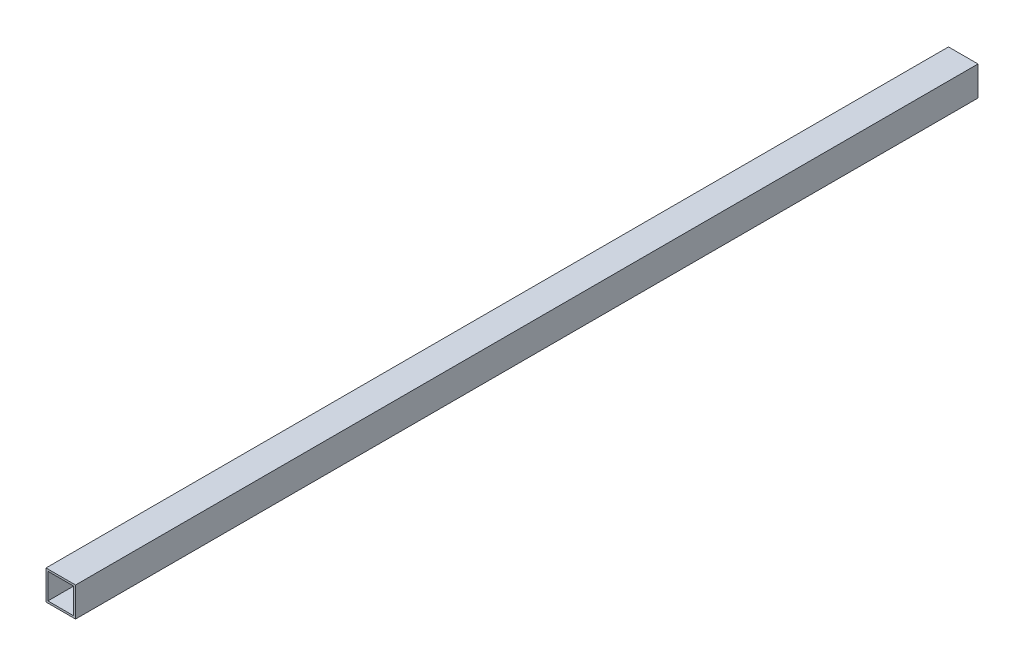
ISO-10303-21;
HEADER;
FILE_DESCRIPTION(('STEP AP214'),'2;1');
FILE_NAME('part.step','',(''),(''),'','','');
FILE_SCHEMA(('AUTOMOTIVE_DESIGN { 1 0 10303 214 1 1 1 1 }'));
ENDSEC;
DATA;
#1=APPLICATION_CONTEXT('core data for automotive mechanical design processes');
#2=APPLICATION_PROTOCOL_DEFINITION('international standard','automotive_design',2000,#1);
#3=PRODUCT_CONTEXT('',#1,'mechanical');
#4=PRODUCT('Part','Part','',(#3));
#5=PRODUCT_RELATED_PRODUCT_CATEGORY('part','',(#4));
#6=PRODUCT_DEFINITION_FORMATION('','',#4);
#7=PRODUCT_DEFINITION_CONTEXT('part definition',#1,'design');
#8=PRODUCT_DEFINITION('design','',#6,#7);
#9=PRODUCT_DEFINITION_SHAPE('','',#8);
#10=(LENGTH_UNIT() NAMED_UNIT(*) SI_UNIT(.MILLI.,.METRE.));
#11=(NAMED_UNIT(*) PLANE_ANGLE_UNIT() SI_UNIT($,.RADIAN.));
#12=(NAMED_UNIT(*) SI_UNIT($,.STERADIAN.) SOLID_ANGLE_UNIT());
#13=UNCERTAINTY_MEASURE_WITH_UNIT(LENGTH_MEASURE(1.E-05),#10,'distance_accuracy_value','');
#14=(GEOMETRIC_REPRESENTATION_CONTEXT(3) GLOBAL_UNCERTAINTY_ASSIGNED_CONTEXT((#13)) GLOBAL_UNIT_ASSIGNED_CONTEXT((#10,
#11,#12)) REPRESENTATION_CONTEXT('',''));
#15=CARTESIAN_POINT('',(0.,0.,0.));
#16=DIRECTION('',(0.,0.,1.));
#17=DIRECTION('',(1.,0.,0.));
#18=AXIS2_PLACEMENT_3D('',#15,#16,#17);
#19=CARTESIAN_POINT('',(-12.7,12.7,-776.));
#20=DIRECTION('',(1.,0.,0.));
#21=DIRECTION('',(0.,0.,-1.));
#22=AXIS2_PLACEMENT_3D('',#19,#20,#21);
#23=PLANE('',#22);
#24=DIRECTION('',(0.,1.,0.));
#25=VECTOR('',#24,1.);
#26=CARTESIAN_POINT('',(-12.7,12.7,0.));
#27=LINE('',#26,#25);
#28=CARTESIAN_POINT('',(-12.7,-12.7,0.));
#29=VERTEX_POINT('',#28);
#30=CARTESIAN_POINT('',(-12.7,12.7,0.));
#31=VERTEX_POINT('',#30);
#32=EDGE_CURVE('E164',#29,#31,#27,.T.);
#33=ORIENTED_EDGE('',*,*,#32,.T.);
#34=DIRECTION('',(0.,0.,1.));
#35=VECTOR('',#34,1.);
#36=CARTESIAN_POINT('',(-12.7,12.7,-776.));
#37=LINE('',#36,#35);
#38=CARTESIAN_POINT('',(-12.7,12.7,-776.));
#39=VERTEX_POINT('',#38);
#40=EDGE_CURVE('E12',#39,#31,#37,.T.);
#41=ORIENTED_EDGE('',*,*,#40,.F.);
#42=DIRECTION('',(0.,1.,0.));
#43=VECTOR('',#42,1.);
#44=CARTESIAN_POINT('',(-12.7,12.7,-776.));
#45=LINE('',#44,#43);
#46=CARTESIAN_POINT('',(-12.7,-12.7,-776.));
#47=VERTEX_POINT('',#46);
#48=EDGE_CURVE('E138',#47,#39,#45,.T.);
#49=ORIENTED_EDGE('',*,*,#48,.F.);
#50=DIRECTION('',(0.,0.,1.));
#51=VECTOR('',#50,1.);
#52=CARTESIAN_POINT('',(-12.7,-12.7,-776.));
#53=LINE('',#52,#51);
#54=EDGE_CURVE('E171',#47,#29,#53,.T.);
#55=ORIENTED_EDGE('',*,*,#54,.T.);
#56=EDGE_LOOP('',(#33,#41,#49,#55));
#57=FACE_BOUND('',#56,.T.);
#58=ADVANCED_FACE('F57',(#57),#23,.F.);
#59=CARTESIAN_POINT('',(-12.7,12.7,-776.));
#60=DIRECTION('',(0.,-1.,0.));
#61=DIRECTION('',(0.,0.,-1.));
#62=AXIS2_PLACEMENT_3D('',#59,#60,#61);
#63=PLANE('',#62);
#64=DIRECTION('',(1.,0.,0.));
#65=VECTOR('',#64,1.);
#66=CARTESIAN_POINT('',(-12.7,12.7,0.));
#67=LINE('',#66,#65);
#68=CARTESIAN_POINT('',(12.7,12.7,0.));
#69=VERTEX_POINT('',#68);
#70=EDGE_CURVE('E143',#31,#69,#67,.T.);
#71=ORIENTED_EDGE('',*,*,#70,.T.);
#72=DIRECTION('',(0.,0.,1.));
#73=VECTOR('',#72,1.);
#74=CARTESIAN_POINT('',(12.7,12.7,-776.));
#75=LINE('',#74,#73);
#76=CARTESIAN_POINT('',(12.7,12.7,-776.));
#77=VERTEX_POINT('',#76);
#78=EDGE_CURVE('E67',#77,#69,#75,.T.);
#79=ORIENTED_EDGE('',*,*,#78,.F.);
#80=DIRECTION('',(1.,0.,0.));
#81=VECTOR('',#80,1.);
#82=CARTESIAN_POINT('',(-12.7,12.7,-776.));
#83=LINE('',#82,#81);
#84=EDGE_CURVE('E132',#39,#77,#83,.T.);
#85=ORIENTED_EDGE('',*,*,#84,.F.);
#86=ORIENTED_EDGE('',*,*,#40,.T.);
#87=EDGE_LOOP('',(#71,#79,#85,#86));
#88=FACE_BOUND('',#87,.T.);
#89=ADVANCED_FACE('F142',(#88),#63,.F.);
#90=CARTESIAN_POINT('',(12.7,-12.7,-776.));
#91=DIRECTION('',(-1.,0.,0.));
#92=DIRECTION('',(0.,-1.,0.));
#93=AXIS2_PLACEMENT_3D('',#90,#91,#92);
#94=PLANE('',#93);
#95=DIRECTION('',(0.,-1.,0.));
#96=VECTOR('',#95,1.);
#97=CARTESIAN_POINT('',(12.7,-12.7,0.));
#98=LINE('',#97,#96);
#99=CARTESIAN_POINT('',(12.7,-12.7,0.));
#100=VERTEX_POINT('',#99);
#101=EDGE_CURVE('E105',#69,#100,#98,.T.);
#102=ORIENTED_EDGE('',*,*,#101,.T.);
#103=DIRECTION('',(0.,0.,1.));
#104=VECTOR('',#103,1.);
#105=CARTESIAN_POINT('',(12.7,-12.7,-776.));
#106=LINE('',#105,#104);
#107=CARTESIAN_POINT('',(12.7,-12.7,-776.));
#108=VERTEX_POINT('',#107);
#109=EDGE_CURVE('E144',#108,#100,#106,.T.);
#110=ORIENTED_EDGE('',*,*,#109,.F.);
#111=DIRECTION('',(0.,-1.,0.));
#112=VECTOR('',#111,1.);
#113=CARTESIAN_POINT('',(12.7,-12.7,-776.));
#114=LINE('',#113,#112);
#115=EDGE_CURVE('E136',#77,#108,#114,.T.);
#116=ORIENTED_EDGE('',*,*,#115,.F.);
#117=ORIENTED_EDGE('',*,*,#78,.T.);
#118=EDGE_LOOP('',(#102,#110,#116,#117));
#119=FACE_BOUND('',#118,.T.);
#120=ADVANCED_FACE('F146',(#119),#94,.F.);
#121=CARTESIAN_POINT('',(-11.049,11.049,-776.));
#122=DIRECTION('',(0.,-1.,0.));
#123=DIRECTION('',(0.,0.,-1.));
#124=AXIS2_PLACEMENT_3D('',#121,#122,#123);
#125=PLANE('',#124);
#126=DIRECTION('',(1.,0.,0.));
#127=VECTOR('',#126,1.);
#128=CARTESIAN_POINT('',(-11.049,11.049,0.));
#129=LINE('',#128,#127);
#130=CARTESIAN_POINT('',(-11.049,11.049,0.));
#131=VERTEX_POINT('',#130);
#132=CARTESIAN_POINT('',(11.049,11.049,0.));
#133=VERTEX_POINT('',#132);
#134=EDGE_CURVE('E152',#131,#133,#129,.T.);
#135=ORIENTED_EDGE('',*,*,#134,.F.);
#136=DIRECTION('',(0.,0.,1.));
#137=VECTOR('',#136,1.);
#138=CARTESIAN_POINT('',(-11.049,11.049,-776.));
#139=LINE('',#138,#137);
#140=CARTESIAN_POINT('',(-11.049,11.049,-776.));
#141=VERTEX_POINT('',#140);
#142=EDGE_CURVE('E61',#141,#131,#139,.T.);
#143=ORIENTED_EDGE('',*,*,#142,.F.);
#144=DIRECTION('',(1.,0.,0.));
#145=VECTOR('',#144,1.);
#146=CARTESIAN_POINT('',(-11.049,11.049,-776.));
#147=LINE('',#146,#145);
#148=CARTESIAN_POINT('',(11.049,11.049,-776.));
#149=VERTEX_POINT('',#148);
#150=EDGE_CURVE('E170',#141,#149,#147,.T.);
#151=ORIENTED_EDGE('',*,*,#150,.T.);
#152=DIRECTION('',(0.,0.,1.));
#153=VECTOR('',#152,1.);
#154=CARTESIAN_POINT('',(11.049,11.049,-776.));
#155=LINE('',#154,#153);
#156=EDGE_CURVE('E148',#149,#133,#155,.T.);
#157=ORIENTED_EDGE('',*,*,#156,.T.);
#158=EDGE_LOOP('',(#135,#143,#151,#157));
#159=FACE_BOUND('',#158,.T.);
#160=ADVANCED_FACE('F59',(#159),#125,.T.);
#161=CARTESIAN_POINT('',(-11.049,11.049,-776.));
#162=DIRECTION('',(1.,0.,0.));
#163=DIRECTION('',(0.,0.,-1.));
#164=AXIS2_PLACEMENT_3D('',#161,#162,#163);
#165=PLANE('',#164);
#166=DIRECTION('',(0.,1.,0.));
#167=VECTOR('',#166,1.);
#168=CARTESIAN_POINT('',(-11.049,11.049,0.));
#169=LINE('',#168,#167);
#170=CARTESIAN_POINT('',(-11.049,-11.049,0.));
#171=VERTEX_POINT('',#170);
#172=EDGE_CURVE('E155',#171,#131,#169,.T.);
#173=ORIENTED_EDGE('',*,*,#172,.F.);
#174=DIRECTION('',(0.,0.,1.));
#175=VECTOR('',#174,1.);
#176=CARTESIAN_POINT('',(-11.049,-11.049,-776.));
#177=LINE('',#176,#175);
#178=CARTESIAN_POINT('',(-11.049,-11.049,-776.));
#179=VERTEX_POINT('',#178);
#180=EDGE_CURVE('E176',#179,#171,#177,.T.);
#181=ORIENTED_EDGE('',*,*,#180,.F.);
#182=DIRECTION('',(0.,1.,0.));
#183=VECTOR('',#182,1.);
#184=CARTESIAN_POINT('',(-11.049,11.049,-776.));
#185=LINE('',#184,#183);
#186=EDGE_CURVE('E185',#179,#141,#185,.T.);
#187=ORIENTED_EDGE('',*,*,#186,.T.);
#188=ORIENTED_EDGE('',*,*,#142,.T.);
#189=EDGE_LOOP('',(#173,#181,#187,#188));
#190=FACE_BOUND('',#189,.T.);
#191=ADVANCED_FACE('F183',(#190),#165,.T.);
#192=CARTESIAN_POINT('',(11.049,-11.049,-776.));
#193=DIRECTION('',(0.,1.,0.));
#194=DIRECTION('',(0.,0.,1.));
#195=AXIS2_PLACEMENT_3D('',#192,#193,#194);
#196=PLANE('',#195);
#197=DIRECTION('',(-1.,0.,0.));
#198=VECTOR('',#197,1.);
#199=CARTESIAN_POINT('',(11.049,-11.049,0.));
#200=LINE('',#199,#198);
#201=CARTESIAN_POINT('',(11.049,-11.049,0.));
#202=VERTEX_POINT('',#201);
#203=EDGE_CURVE('E158',#202,#171,#200,.T.);
#204=ORIENTED_EDGE('',*,*,#203,.F.);
#205=DIRECTION('',(0.,0.,1.));
#206=VECTOR('',#205,1.);
#207=CARTESIAN_POINT('',(11.049,-11.049,-776.));
#208=LINE('',#207,#206);
#209=CARTESIAN_POINT('',(11.049,-11.049,-776.));
#210=VERTEX_POINT('',#209);
#211=EDGE_CURVE('E175',#210,#202,#208,.T.);
#212=ORIENTED_EDGE('',*,*,#211,.F.);
#213=DIRECTION('',(-1.,0.,0.));
#214=VECTOR('',#213,1.);
#215=CARTESIAN_POINT('',(11.049,-11.049,-776.));
#216=LINE('',#215,#214);
#217=EDGE_CURVE('E192',#210,#179,#216,.T.);
#218=ORIENTED_EDGE('',*,*,#217,.T.);
#219=ORIENTED_EDGE('',*,*,#180,.T.);
#220=EDGE_LOOP('',(#204,#212,#218,#219));
#221=FACE_BOUND('',#220,.T.);
#222=ADVANCED_FACE('F190',(#221),#196,.T.);
#223=CARTESIAN_POINT('',(11.049,-11.049,-776.));
#224=DIRECTION('',(-1.,0.,0.));
#225=DIRECTION('',(0.,0.,1.));
#226=AXIS2_PLACEMENT_3D('',#223,#224,#225);
#227=PLANE('',#226);
#228=DIRECTION('',(0.,-1.,0.));
#229=VECTOR('',#228,1.);
#230=CARTESIAN_POINT('',(11.049,-11.049,0.));
#231=LINE('',#230,#229);
#232=EDGE_CURVE('E161',#133,#202,#231,.T.);
#233=ORIENTED_EDGE('',*,*,#232,.F.);
#234=ORIENTED_EDGE('',*,*,#156,.F.);
#235=DIRECTION('',(0.,-1.,0.));
#236=VECTOR('',#235,1.);
#237=CARTESIAN_POINT('',(11.049,-11.049,-776.));
#238=LINE('',#237,#236);
#239=EDGE_CURVE('E197',#149,#210,#238,.T.);
#240=ORIENTED_EDGE('',*,*,#239,.T.);
#241=ORIENTED_EDGE('',*,*,#211,.T.);
#242=EDGE_LOOP('',(#233,#234,#240,#241));
#243=FACE_BOUND('',#242,.T.);
#244=ADVANCED_FACE('F199',(#243),#227,.T.);
#245=CARTESIAN_POINT('',(12.7,-12.7,-776.));
#246=DIRECTION('',(0.,1.,0.));
#247=DIRECTION('',(-1.,0.,0.));
#248=AXIS2_PLACEMENT_3D('',#245,#246,#247);
#249=PLANE('',#248);
#250=DIRECTION('',(-1.,0.,0.));
#251=VECTOR('',#250,1.);
#252=CARTESIAN_POINT('',(12.7,-12.7,0.));
#253=LINE('',#252,#251);
#254=EDGE_CURVE('E111',#100,#29,#253,.T.);
#255=ORIENTED_EDGE('',*,*,#254,.T.);
#256=ORIENTED_EDGE('',*,*,#54,.F.);
#257=DIRECTION('',(-1.,0.,0.));
#258=VECTOR('',#257,1.);
#259=CARTESIAN_POINT('',(12.7,-12.7,-776.));
#260=LINE('',#259,#258);
#261=EDGE_CURVE('E76',#108,#47,#260,.T.);
#262=ORIENTED_EDGE('',*,*,#261,.F.);
#263=ORIENTED_EDGE('',*,*,#109,.T.);
#264=EDGE_LOOP('',(#255,#256,#262,#263));
#265=FACE_BOUND('',#264,.T.);
#266=ADVANCED_FACE('F204',(#265),#249,.F.);
#267=CARTESIAN_POINT('',(0.,0.,-776.));
#268=DIRECTION('',(0.,0.,-1.));
#269=DIRECTION('',(-1.,0.,0.));
#270=AXIS2_PLACEMENT_3D('',#267,#268,#269);
#271=PLANE('',#270);
#272=ORIENTED_EDGE('',*,*,#150,.F.);
#273=ORIENTED_EDGE('',*,*,#186,.F.);
#274=ORIENTED_EDGE('',*,*,#217,.F.);
#275=ORIENTED_EDGE('',*,*,#239,.F.);
#276=EDGE_LOOP('',(#272,#273,#274,#275));
#277=FACE_BOUND('',#276,.T.);
#278=ORIENTED_EDGE('',*,*,#48,.T.);
#279=ORIENTED_EDGE('',*,*,#84,.T.);
#280=ORIENTED_EDGE('',*,*,#115,.T.);
#281=ORIENTED_EDGE('',*,*,#261,.T.);
#282=EDGE_LOOP('',(#278,#279,#280,#281));
#283=FACE_BOUND('',#282,.T.);
#284=ADVANCED_FACE('F134',(#277,#283),#271,.T.);
#285=CARTESIAN_POINT('',(0.,0.,0.));
#286=DIRECTION('',(0.,0.,-1.));
#287=DIRECTION('',(-1.,0.,0.));
#288=AXIS2_PLACEMENT_3D('',#285,#286,#287);
#289=PLANE('',#288);
#290=ORIENTED_EDGE('',*,*,#134,.T.);
#291=ORIENTED_EDGE('',*,*,#232,.T.);
#292=ORIENTED_EDGE('',*,*,#203,.T.);
#293=ORIENTED_EDGE('',*,*,#172,.T.);
#294=EDGE_LOOP('',(#290,#291,#292,#293));
#295=FACE_BOUND('',#294,.T.);
#296=ORIENTED_EDGE('',*,*,#32,.F.);
#297=ORIENTED_EDGE('',*,*,#254,.F.);
#298=ORIENTED_EDGE('',*,*,#101,.F.);
#299=ORIENTED_EDGE('',*,*,#70,.F.);
#300=EDGE_LOOP('',(#296,#297,#298,#299));
#301=FACE_BOUND('',#300,.T.);
#302=ADVANCED_FACE('F188',(#295,#301),#289,.F.);
#303=CLOSED_SHELL('',(#58,#89,#120,#160,#191,#222,#244,#266,#284,#302));
#304=MANIFOLD_SOLID_BREP('B2',#303);
#305=ADVANCED_BREP_SHAPE_REPRESENTATION('',(#18,#304),#14);
#306=SHAPE_DEFINITION_REPRESENTATION(#9,#305);
ENDSEC;
END-ISO-10303-21;
